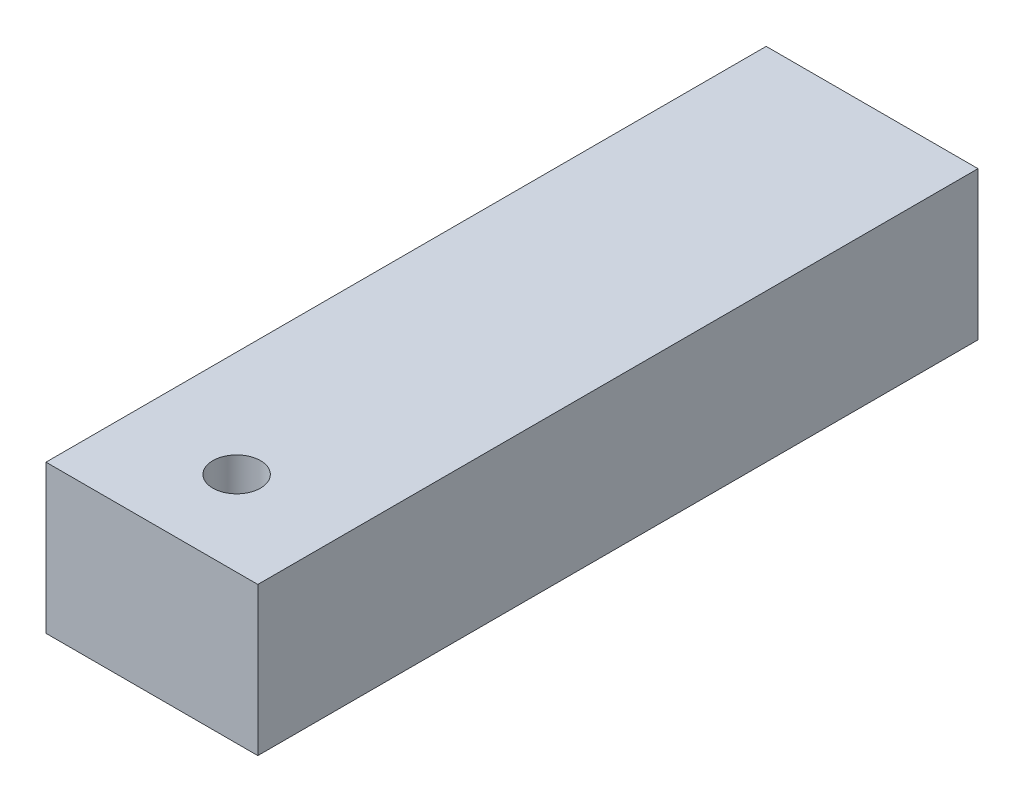
ISO-10303-21;
HEADER;
FILE_DESCRIPTION(('STEP AP214'),'2;1');
FILE_NAME('part.step','',(''),(''),'','','');
FILE_SCHEMA(('AUTOMOTIVE_DESIGN { 1 0 10303 214 1 1 1 1 }'));
ENDSEC;
DATA;
#1=APPLICATION_CONTEXT('core data for automotive mechanical design processes');
#2=APPLICATION_PROTOCOL_DEFINITION('international standard','automotive_design',2000,#1);
#3=PRODUCT_CONTEXT('',#1,'mechanical');
#4=PRODUCT('Part','Part','',(#3));
#5=PRODUCT_RELATED_PRODUCT_CATEGORY('part','',(#4));
#6=PRODUCT_DEFINITION_FORMATION('','',#4);
#7=PRODUCT_DEFINITION_CONTEXT('part definition',#1,'design');
#8=PRODUCT_DEFINITION('design','',#6,#7);
#9=PRODUCT_DEFINITION_SHAPE('','',#8);
#10=(LENGTH_UNIT() NAMED_UNIT(*) SI_UNIT(.MILLI.,.METRE.));
#11=(NAMED_UNIT(*) PLANE_ANGLE_UNIT() SI_UNIT($,.RADIAN.));
#12=(NAMED_UNIT(*) SI_UNIT($,.STERADIAN.) SOLID_ANGLE_UNIT());
#13=UNCERTAINTY_MEASURE_WITH_UNIT(LENGTH_MEASURE(1.E-05),#10,'distance_accuracy_value','');
#14=(GEOMETRIC_REPRESENTATION_CONTEXT(3) GLOBAL_UNCERTAINTY_ASSIGNED_CONTEXT((#13)) GLOBAL_UNIT_ASSIGNED_CONTEXT((#10,
#11,#12)) REPRESENTATION_CONTEXT('',''));
#15=CARTESIAN_POINT('',(0.,0.,0.));
#16=DIRECTION('',(0.,0.,1.));
#17=DIRECTION('',(1.,0.,0.));
#18=AXIS2_PLACEMENT_3D('',#15,#16,#17);
#19=CARTESIAN_POINT('',(-25.,17.5,170.));
#20=DIRECTION('',(1.,0.,0.));
#21=DIRECTION('',(0.,1.,0.));
#22=AXIS2_PLACEMENT_3D('',#19,#20,#21);
#23=PLANE('',#22);
#24=DIRECTION('',(0.,-1.,0.));
#25=VECTOR('',#24,1.);
#26=CARTESIAN_POINT('',(-25.,17.5,0.));
#27=LINE('',#26,#25);
#28=CARTESIAN_POINT('',(-25.,17.5,0.));
#29=VERTEX_POINT('',#28);
#30=CARTESIAN_POINT('',(-25.,-17.5,0.));
#31=VERTEX_POINT('',#30);
#32=EDGE_CURVE('E104',#29,#31,#27,.T.);
#33=ORIENTED_EDGE('',*,*,#32,.T.);
#34=DIRECTION('',(0.,0.,-1.));
#35=VECTOR('',#34,1.);
#36=CARTESIAN_POINT('',(-25.,-17.5,170.));
#37=LINE('',#36,#35);
#38=CARTESIAN_POINT('',(-25.,-17.5,170.));
#39=VERTEX_POINT('',#38);
#40=EDGE_CURVE('E12',#39,#31,#37,.T.);
#41=ORIENTED_EDGE('',*,*,#40,.F.);
#42=DIRECTION('',(0.,-1.,0.));
#43=VECTOR('',#42,1.);
#44=CARTESIAN_POINT('',(-25.,17.5,170.));
#45=LINE('',#44,#43);
#46=CARTESIAN_POINT('',(-25.,17.5,170.));
#47=VERTEX_POINT('',#46);
#48=EDGE_CURVE('E91',#47,#39,#45,.T.);
#49=ORIENTED_EDGE('',*,*,#48,.F.);
#50=DIRECTION('',(0.,0.,-1.));
#51=VECTOR('',#50,1.);
#52=CARTESIAN_POINT('',(-25.,17.5,170.));
#53=LINE('',#52,#51);
#54=EDGE_CURVE('E99',#47,#29,#53,.T.);
#55=ORIENTED_EDGE('',*,*,#54,.T.);
#56=EDGE_LOOP('',(#33,#41,#49,#55));
#57=FACE_BOUND('',#56,.T.);
#58=ADVANCED_FACE('F40',(#57),#23,.F.);
#59=CARTESIAN_POINT('',(-25.,-17.5,170.));
#60=DIRECTION('',(0.,1.,0.));
#61=DIRECTION('',(0.,0.,1.));
#62=AXIS2_PLACEMENT_3D('',#59,#60,#61);
#63=PLANE('',#62);
#64=CARTESIAN_POINT('',(0.,-17.5,150.));
#65=DIRECTION('',(0.,1.,0.));
#66=DIRECTION('',(0.,0.,1.));
#67=AXIS2_PLACEMENT_3D('',#64,#65,#66);
#68=CIRCLE('',#67,5.63475849776296);
#69=CARTESIAN_POINT('',(0.,-17.5,155.634758497763));
#70=VERTEX_POINT('',#69);
#71=EDGE_CURVE('E107',#70,#70,#68,.T.);
#72=ORIENTED_EDGE('',*,*,#71,.T.);
#73=EDGE_LOOP('',(#72));
#74=FACE_BOUND('',#73,.T.);
#75=DIRECTION('',(1.,0.,0.));
#76=VECTOR('',#75,1.);
#77=CARTESIAN_POINT('',(-25.,-17.5,0.));
#78=LINE('',#77,#76);
#79=CARTESIAN_POINT('',(25.,-17.5,0.));
#80=VERTEX_POINT('',#79);
#81=EDGE_CURVE('E95',#31,#80,#78,.T.);
#82=ORIENTED_EDGE('',*,*,#81,.T.);
#83=DIRECTION('',(0.,0.,-1.));
#84=VECTOR('',#83,1.);
#85=CARTESIAN_POINT('',(25.,-17.5,170.));
#86=LINE('',#85,#84);
#87=CARTESIAN_POINT('',(25.,-17.5,170.));
#88=VERTEX_POINT('',#87);
#89=EDGE_CURVE('E48',#88,#80,#86,.T.);
#90=ORIENTED_EDGE('',*,*,#89,.F.);
#91=DIRECTION('',(1.,0.,0.));
#92=VECTOR('',#91,1.);
#93=CARTESIAN_POINT('',(-25.,-17.5,170.));
#94=LINE('',#93,#92);
#95=EDGE_CURVE('E86',#39,#88,#94,.T.);
#96=ORIENTED_EDGE('',*,*,#95,.F.);
#97=ORIENTED_EDGE('',*,*,#40,.T.);
#98=EDGE_LOOP('',(#82,#90,#96,#97));
#99=FACE_BOUND('',#98,.T.);
#100=ADVANCED_FACE('F94',(#74,#99),#63,.F.);
#101=CARTESIAN_POINT('',(25.,17.5,170.));
#102=DIRECTION('',(-1.,0.,0.));
#103=DIRECTION('',(0.,-1.,0.));
#104=AXIS2_PLACEMENT_3D('',#101,#102,#103);
#105=PLANE('',#104);
#106=DIRECTION('',(0.,1.,0.));
#107=VECTOR('',#106,1.);
#108=CARTESIAN_POINT('',(25.,17.5,0.));
#109=LINE('',#108,#107);
#110=CARTESIAN_POINT('',(25.,17.5,0.));
#111=VERTEX_POINT('',#110);
#112=EDGE_CURVE('E73',#80,#111,#109,.T.);
#113=ORIENTED_EDGE('',*,*,#112,.T.);
#114=DIRECTION('',(0.,0.,-1.));
#115=VECTOR('',#114,1.);
#116=CARTESIAN_POINT('',(25.,17.5,170.));
#117=LINE('',#116,#115);
#118=CARTESIAN_POINT('',(25.,17.5,170.));
#119=VERTEX_POINT('',#118);
#120=EDGE_CURVE('E96',#119,#111,#117,.T.);
#121=ORIENTED_EDGE('',*,*,#120,.F.);
#122=DIRECTION('',(0.,1.,0.));
#123=VECTOR('',#122,1.);
#124=CARTESIAN_POINT('',(25.,17.5,170.));
#125=LINE('',#124,#123);
#126=EDGE_CURVE('E89',#88,#119,#125,.T.);
#127=ORIENTED_EDGE('',*,*,#126,.F.);
#128=ORIENTED_EDGE('',*,*,#89,.T.);
#129=EDGE_LOOP('',(#113,#121,#127,#128));
#130=FACE_BOUND('',#129,.T.);
#131=ADVANCED_FACE('F97',(#130),#105,.F.);
#132=CARTESIAN_POINT('',(-25.,17.5,170.));
#133=DIRECTION('',(0.,-1.,0.));
#134=DIRECTION('',(0.,0.,-1.));
#135=AXIS2_PLACEMENT_3D('',#132,#133,#134);
#136=PLANE('',#135);
#137=CARTESIAN_POINT('',(0.,17.5,150.));
#138=DIRECTION('',(0.,1.,0.));
#139=DIRECTION('',(0.,0.,1.));
#140=AXIS2_PLACEMENT_3D('',#137,#138,#139);
#141=CIRCLE('',#140,5.63475849776296);
#142=CARTESIAN_POINT('',(0.,17.5,155.634758497763));
#143=VERTEX_POINT('',#142);
#144=EDGE_CURVE('E120',#143,#143,#141,.T.);
#145=ORIENTED_EDGE('',*,*,#144,.F.);
#146=EDGE_LOOP('',(#145));
#147=FACE_BOUND('',#146,.T.);
#148=DIRECTION('',(-1.,0.,0.));
#149=VECTOR('',#148,1.);
#150=CARTESIAN_POINT('',(-25.,17.5,0.));
#151=LINE('',#150,#149);
#152=EDGE_CURVE('E79',#111,#29,#151,.T.);
#153=ORIENTED_EDGE('',*,*,#152,.T.);
#154=ORIENTED_EDGE('',*,*,#54,.F.);
#155=DIRECTION('',(-1.,0.,0.));
#156=VECTOR('',#155,1.);
#157=CARTESIAN_POINT('',(-25.,17.5,170.));
#158=LINE('',#157,#156);
#159=EDGE_CURVE('E56',#119,#47,#158,.T.);
#160=ORIENTED_EDGE('',*,*,#159,.F.);
#161=ORIENTED_EDGE('',*,*,#120,.T.);
#162=EDGE_LOOP('',(#153,#154,#160,#161));
#163=FACE_BOUND('',#162,.T.);
#164=ADVANCED_FACE('F112',(#147,#163),#136,.F.);
#165=CARTESIAN_POINT('',(-25.,-17.5,170.));
#166=DIRECTION('',(0.,0.,1.));
#167=DIRECTION('',(1.,0.,0.));
#168=AXIS2_PLACEMENT_3D('',#165,#166,#167);
#169=PLANE('',#168);
#170=ORIENTED_EDGE('',*,*,#48,.T.);
#171=ORIENTED_EDGE('',*,*,#95,.T.);
#172=ORIENTED_EDGE('',*,*,#126,.T.);
#173=ORIENTED_EDGE('',*,*,#159,.T.);
#174=EDGE_LOOP('',(#170,#171,#172,#173));
#175=FACE_BOUND('',#174,.T.);
#176=ADVANCED_FACE('F87',(#175),#169,.T.);
#177=CARTESIAN_POINT('',(-25.,-17.5,0.));
#178=DIRECTION('',(0.,0.,1.));
#179=DIRECTION('',(1.,0.,0.));
#180=AXIS2_PLACEMENT_3D('',#177,#178,#179);
#181=PLANE('',#180);
#182=ORIENTED_EDGE('',*,*,#32,.F.);
#183=ORIENTED_EDGE('',*,*,#152,.F.);
#184=ORIENTED_EDGE('',*,*,#112,.F.);
#185=ORIENTED_EDGE('',*,*,#81,.F.);
#186=EDGE_LOOP('',(#182,#183,#184,#185));
#187=FACE_BOUND('',#186,.T.);
#188=ADVANCED_FACE('F115',(#187),#181,.F.);
#189=CARTESIAN_POINT('',(0.,-17.5,150.));
#190=DIRECTION('',(0.,1.,0.));
#191=DIRECTION('',(0.,0.,1.));
#192=AXIS2_PLACEMENT_3D('',#189,#190,#191);
#193=CYLINDRICAL_SURFACE('',#192,5.63475849776296);
#194=ORIENTED_EDGE('',*,*,#71,.F.);
#195=EDGE_LOOP('',(#194));
#196=FACE_BOUND('',#195,.T.);
#197=ORIENTED_EDGE('',*,*,#144,.T.);
#198=EDGE_LOOP('',(#197));
#199=FACE_BOUND('',#198,.T.);
#200=ADVANCED_FACE('F133',(#196,#199),#193,.F.);
#201=CLOSED_SHELL('',(#58,#100,#131,#164,#176,#188,#200));
#202=MANIFOLD_SOLID_BREP('B2',#201);
#203=ADVANCED_BREP_SHAPE_REPRESENTATION('',(#18,#202),#14);
#204=SHAPE_DEFINITION_REPRESENTATION(#9,#203);
ENDSEC;
END-ISO-10303-21;
